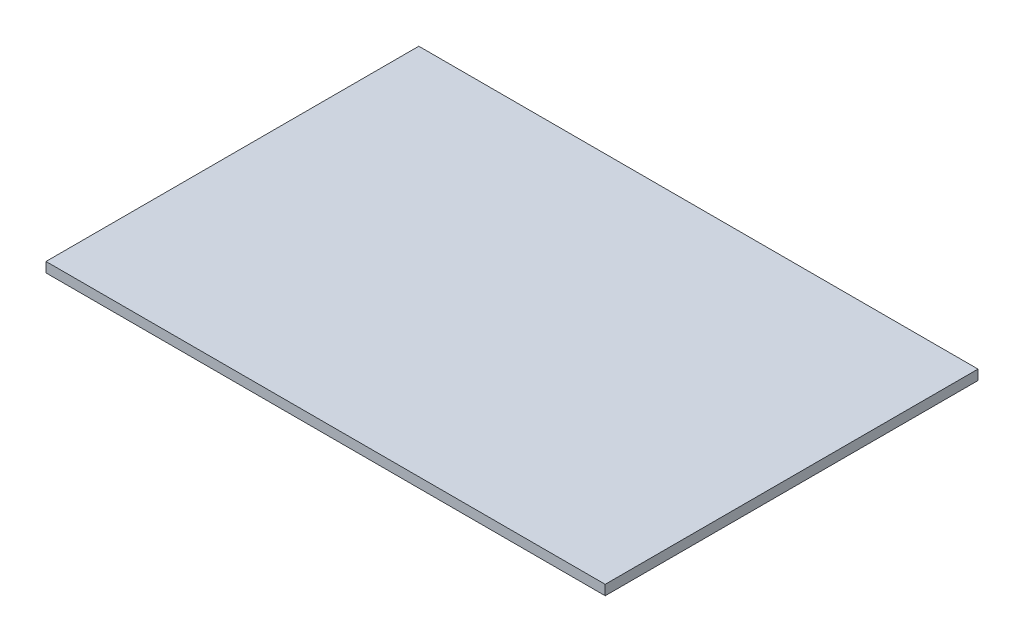
ISO-10303-21;
HEADER;
FILE_DESCRIPTION(('STEP AP214'),'2;1');
FILE_NAME('part.step','',(''),(''),'','','');
FILE_SCHEMA(('AUTOMOTIVE_DESIGN { 1 0 10303 214 1 1 1 1 }'));
ENDSEC;
DATA;
#1=APPLICATION_CONTEXT('core data for automotive mechanical design processes');
#2=APPLICATION_PROTOCOL_DEFINITION('international standard','automotive_design',2000,#1);
#3=PRODUCT_CONTEXT('',#1,'mechanical');
#4=PRODUCT('Part','Part','',(#3));
#5=PRODUCT_RELATED_PRODUCT_CATEGORY('part','',(#4));
#6=PRODUCT_DEFINITION_FORMATION('','',#4);
#7=PRODUCT_DEFINITION_CONTEXT('part definition',#1,'design');
#8=PRODUCT_DEFINITION('design','',#6,#7);
#9=PRODUCT_DEFINITION_SHAPE('','',#8);
#10=(LENGTH_UNIT() NAMED_UNIT(*) SI_UNIT(.MILLI.,.METRE.));
#11=(NAMED_UNIT(*) PLANE_ANGLE_UNIT() SI_UNIT($,.RADIAN.));
#12=(NAMED_UNIT(*) SI_UNIT($,.STERADIAN.) SOLID_ANGLE_UNIT());
#13=UNCERTAINTY_MEASURE_WITH_UNIT(LENGTH_MEASURE(1.E-05),#10,'distance_accuracy_value','');
#14=(GEOMETRIC_REPRESENTATION_CONTEXT(3) GLOBAL_UNCERTAINTY_ASSIGNED_CONTEXT((#13)) GLOBAL_UNIT_ASSIGNED_CONTEXT((#10,
#11,#12)) REPRESENTATION_CONTEXT('',''));
#15=CARTESIAN_POINT('',(0.,0.,0.));
#16=DIRECTION('',(0.,0.,1.));
#17=DIRECTION('',(1.,0.,0.));
#18=AXIS2_PLACEMENT_3D('',#15,#16,#17);
#19=CARTESIAN_POINT('',(450.,16.,300.));
#20=DIRECTION('',(-1.,0.,0.));
#21=DIRECTION('',(0.,0.,1.));
#22=AXIS2_PLACEMENT_3D('',#19,#20,#21);
#23=PLANE('',#22);
#24=DIRECTION('',(0.,0.,-1.));
#25=VECTOR('',#24,1.);
#26=CARTESIAN_POINT('',(450.,0.,300.));
#27=LINE('',#26,#25);
#28=CARTESIAN_POINT('',(450.,0.,300.));
#29=VERTEX_POINT('',#28);
#30=CARTESIAN_POINT('',(450.,0.,-300.));
#31=VERTEX_POINT('',#30);
#32=EDGE_CURVE('E101',#29,#31,#27,.T.);
#33=ORIENTED_EDGE('',*,*,#32,.T.);
#34=DIRECTION('',(0.,-1.,0.));
#35=VECTOR('',#34,1.);
#36=CARTESIAN_POINT('',(450.,16.,-300.));
#37=LINE('',#36,#35);
#38=CARTESIAN_POINT('',(450.,16.,-300.));
#39=VERTEX_POINT('',#38);
#40=EDGE_CURVE('E11',#39,#31,#37,.T.);
#41=ORIENTED_EDGE('',*,*,#40,.F.);
#42=DIRECTION('',(0.,0.,-1.));
#43=VECTOR('',#42,1.);
#44=CARTESIAN_POINT('',(450.,16.,300.));
#45=LINE('',#44,#43);
#46=CARTESIAN_POINT('',(450.,16.,300.));
#47=VERTEX_POINT('',#46);
#48=EDGE_CURVE('E89',#47,#39,#45,.T.);
#49=ORIENTED_EDGE('',*,*,#48,.F.);
#50=DIRECTION('',(0.,-1.,0.));
#51=VECTOR('',#50,1.);
#52=CARTESIAN_POINT('',(450.,16.,300.));
#53=LINE('',#52,#51);
#54=EDGE_CURVE('E97',#47,#29,#53,.T.);
#55=ORIENTED_EDGE('',*,*,#54,.T.);
#56=EDGE_LOOP('',(#33,#41,#49,#55));
#57=FACE_BOUND('',#56,.T.);
#58=ADVANCED_FACE('F38',(#57),#23,.F.);
#59=CARTESIAN_POINT('',(-450.,16.,-300.));
#60=DIRECTION('',(0.,0.,1.));
#61=DIRECTION('',(1.,0.,0.));
#62=AXIS2_PLACEMENT_3D('',#59,#60,#61);
#63=PLANE('',#62);
#64=DIRECTION('',(-1.,0.,0.));
#65=VECTOR('',#64,1.);
#66=CARTESIAN_POINT('',(-450.,0.,-300.));
#67=LINE('',#66,#65);
#68=CARTESIAN_POINT('',(-450.,0.,-300.));
#69=VERTEX_POINT('',#68);
#70=EDGE_CURVE('E93',#31,#69,#67,.T.);
#71=ORIENTED_EDGE('',*,*,#70,.T.);
#72=DIRECTION('',(0.,-1.,0.));
#73=VECTOR('',#72,1.);
#74=CARTESIAN_POINT('',(-450.,16.,-300.));
#75=LINE('',#74,#73);
#76=CARTESIAN_POINT('',(-450.,16.,-300.));
#77=VERTEX_POINT('',#76);
#78=EDGE_CURVE('E46',#77,#69,#75,.T.);
#79=ORIENTED_EDGE('',*,*,#78,.F.);
#80=DIRECTION('',(-1.,0.,0.));
#81=VECTOR('',#80,1.);
#82=CARTESIAN_POINT('',(-450.,16.,-300.));
#83=LINE('',#82,#81);
#84=EDGE_CURVE('E84',#39,#77,#83,.T.);
#85=ORIENTED_EDGE('',*,*,#84,.F.);
#86=ORIENTED_EDGE('',*,*,#40,.T.);
#87=EDGE_LOOP('',(#71,#79,#85,#86));
#88=FACE_BOUND('',#87,.T.);
#89=ADVANCED_FACE('F92',(#88),#63,.F.);
#90=CARTESIAN_POINT('',(-450.,16.,300.));
#91=DIRECTION('',(1.,0.,0.));
#92=DIRECTION('',(0.,0.,-1.));
#93=AXIS2_PLACEMENT_3D('',#90,#91,#92);
#94=PLANE('',#93);
#95=DIRECTION('',(0.,0.,1.));
#96=VECTOR('',#95,1.);
#97=CARTESIAN_POINT('',(-450.,0.,300.));
#98=LINE('',#97,#96);
#99=CARTESIAN_POINT('',(-450.,0.,300.));
#100=VERTEX_POINT('',#99);
#101=EDGE_CURVE('E71',#69,#100,#98,.T.);
#102=ORIENTED_EDGE('',*,*,#101,.T.);
#103=DIRECTION('',(0.,-1.,0.));
#104=VECTOR('',#103,1.);
#105=CARTESIAN_POINT('',(-450.,16.,300.));
#106=LINE('',#105,#104);
#107=CARTESIAN_POINT('',(-450.,16.,300.));
#108=VERTEX_POINT('',#107);
#109=EDGE_CURVE('E94',#108,#100,#106,.T.);
#110=ORIENTED_EDGE('',*,*,#109,.F.);
#111=DIRECTION('',(0.,0.,1.));
#112=VECTOR('',#111,1.);
#113=CARTESIAN_POINT('',(-450.,16.,300.));
#114=LINE('',#113,#112);
#115=EDGE_CURVE('E87',#77,#108,#114,.T.);
#116=ORIENTED_EDGE('',*,*,#115,.F.);
#117=ORIENTED_EDGE('',*,*,#78,.T.);
#118=EDGE_LOOP('',(#102,#110,#116,#117));
#119=FACE_BOUND('',#118,.T.);
#120=ADVANCED_FACE('F95',(#119),#94,.F.);
#121=CARTESIAN_POINT('',(-450.,16.,300.));
#122=DIRECTION('',(0.,0.,-1.));
#123=DIRECTION('',(-1.,0.,0.));
#124=AXIS2_PLACEMENT_3D('',#121,#122,#123);
#125=PLANE('',#124);
#126=DIRECTION('',(1.,0.,0.));
#127=VECTOR('',#126,1.);
#128=CARTESIAN_POINT('',(-450.,0.,300.));
#129=LINE('',#128,#127);
#130=EDGE_CURVE('E77',#100,#29,#129,.T.);
#131=ORIENTED_EDGE('',*,*,#130,.T.);
#132=ORIENTED_EDGE('',*,*,#54,.F.);
#133=DIRECTION('',(1.,0.,0.));
#134=VECTOR('',#133,1.);
#135=CARTESIAN_POINT('',(-450.,16.,300.));
#136=LINE('',#135,#134);
#137=EDGE_CURVE('E54',#108,#47,#136,.T.);
#138=ORIENTED_EDGE('',*,*,#137,.F.);
#139=ORIENTED_EDGE('',*,*,#109,.T.);
#140=EDGE_LOOP('',(#131,#132,#138,#139));
#141=FACE_BOUND('',#140,.T.);
#142=ADVANCED_FACE('F108',(#141),#125,.F.);
#143=CARTESIAN_POINT('',(0.,16.,0.));
#144=DIRECTION('',(0.,-1.,0.));
#145=DIRECTION('',(0.,0.,-1.));
#146=AXIS2_PLACEMENT_3D('',#143,#144,#145);
#147=PLANE('',#146);
#148=ORIENTED_EDGE('',*,*,#48,.T.);
#149=ORIENTED_EDGE('',*,*,#84,.T.);
#150=ORIENTED_EDGE('',*,*,#115,.T.);
#151=ORIENTED_EDGE('',*,*,#137,.T.);
#152=EDGE_LOOP('',(#148,#149,#150,#151));
#153=FACE_BOUND('',#152,.T.);
#154=ADVANCED_FACE('F85',(#153),#147,.F.);
#155=CARTESIAN_POINT('',(0.,0.,0.));
#156=DIRECTION('',(0.,-1.,0.));
#157=DIRECTION('',(0.,0.,-1.));
#158=AXIS2_PLACEMENT_3D('',#155,#156,#157);
#159=PLANE('',#158);
#160=ORIENTED_EDGE('',*,*,#32,.F.);
#161=ORIENTED_EDGE('',*,*,#130,.F.);
#162=ORIENTED_EDGE('',*,*,#101,.F.);
#163=ORIENTED_EDGE('',*,*,#70,.F.);
#164=EDGE_LOOP('',(#160,#161,#162,#163));
#165=FACE_BOUND('',#164,.T.);
#166=ADVANCED_FACE('F111',(#165),#159,.T.);
#167=CLOSED_SHELL('',(#58,#89,#120,#142,#154,#166));
#168=MANIFOLD_SOLID_BREP('B2',#167);
#169=ADVANCED_BREP_SHAPE_REPRESENTATION('',(#18,#168),#14);
#170=SHAPE_DEFINITION_REPRESENTATION(#9,#169);
ENDSEC;
END-ISO-10303-21;
